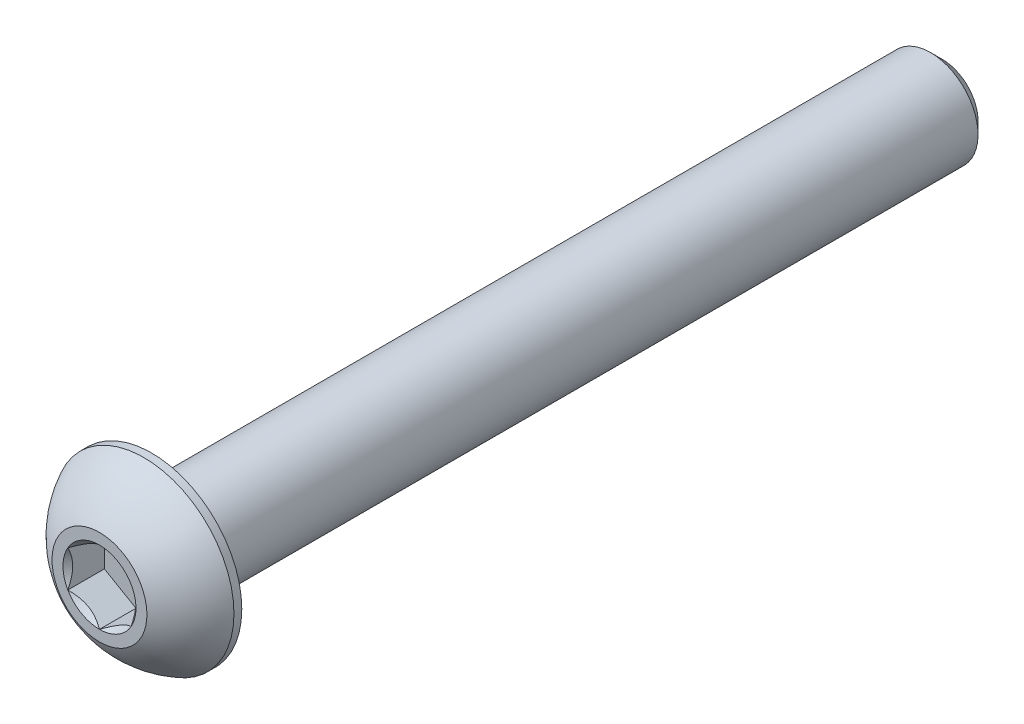
ISO-10303-21;
HEADER;
FILE_DESCRIPTION(('STEP AP214'),'2;1');
FILE_NAME('part.step','',(''),(''),'','','');
FILE_SCHEMA(('AUTOMOTIVE_DESIGN { 1 0 10303 214 1 1 1 1 }'));
ENDSEC;
DATA;
#1=APPLICATION_CONTEXT('core data for automotive mechanical design processes');
#2=APPLICATION_PROTOCOL_DEFINITION('international standard','automotive_design',2000,#1);
#3=PRODUCT_CONTEXT('',#1,'mechanical');
#4=PRODUCT('Part','Part','',(#3));
#5=PRODUCT_RELATED_PRODUCT_CATEGORY('part','',(#4));
#6=PRODUCT_DEFINITION_FORMATION('','',#4);
#7=PRODUCT_DEFINITION_CONTEXT('part definition',#1,'design');
#8=PRODUCT_DEFINITION('design','',#6,#7);
#9=PRODUCT_DEFINITION_SHAPE('','',#8);
#10=(LENGTH_UNIT() NAMED_UNIT(*) SI_UNIT(.MILLI.,.METRE.));
#11=(NAMED_UNIT(*) PLANE_ANGLE_UNIT() SI_UNIT($,.RADIAN.));
#12=(NAMED_UNIT(*) SI_UNIT($,.STERADIAN.) SOLID_ANGLE_UNIT());
#13=UNCERTAINTY_MEASURE_WITH_UNIT(LENGTH_MEASURE(1.E-05),#10,'distance_accuracy_value','');
#14=(GEOMETRIC_REPRESENTATION_CONTEXT(3) GLOBAL_UNCERTAINTY_ASSIGNED_CONTEXT((#13)) GLOBAL_UNIT_ASSIGNED_CONTEXT((#10,
#11,#12)) REPRESENTATION_CONTEXT('',''));
#15=CARTESIAN_POINT('',(0.,0.,0.));
#16=DIRECTION('',(0.,0.,1.));
#17=DIRECTION('',(1.,0.,0.));
#18=AXIS2_PLACEMENT_3D('',#15,#16,#17);
#19=CARTESIAN_POINT('',(0.,-1.5,-26.65));
#20=DIRECTION('',(0.,0.,-1.));
#21=DIRECTION('',(0.,1.,0.));
#22=AXIS2_PLACEMENT_3D('',#19,#20,#21);
#23=PLANE('',#22);
#24=CARTESIAN_POINT('',(0.,0.,-26.65));
#25=DIRECTION('',(0.,0.,-1.));
#26=DIRECTION('',(0.,1.,0.));
#27=AXIS2_PLACEMENT_3D('',#24,#25,#26);
#28=CIRCLE('',#27,1.125);
#29=CARTESIAN_POINT('',(0.,1.125,-26.65));
#30=VERTEX_POINT('',#29);
#31=EDGE_CURVE('E173',#30,#30,#28,.T.);
#32=ORIENTED_EDGE('',*,*,#31,.T.);
#33=EDGE_LOOP('',(#32));
#34=FACE_BOUND('',#33,.T.);
#35=ADVANCED_FACE('F34',(#34),#23,.T.);
#36=CARTESIAN_POINT('',(0.,0.,-26.65));
#37=DIRECTION('',(0.,0.,-1.));
#38=DIRECTION('',(0.,1.,0.));
#39=AXIS2_PLACEMENT_3D('',#36,#37,#38);
#40=CYLINDRICAL_SURFACE('',#39,1.5);
#41=CARTESIAN_POINT('',(0.,0.,-26.275));
#42=DIRECTION('',(0.,0.,-1.));
#43=DIRECTION('',(0.,1.,0.));
#44=AXIS2_PLACEMENT_3D('',#41,#42,#43);
#45=CIRCLE('',#44,1.5);
#46=CARTESIAN_POINT('',(0.,1.5,-26.275));
#47=VERTEX_POINT('',#46);
#48=EDGE_CURVE('E47',#47,#47,#45,.F.);
#49=ORIENTED_EDGE('',*,*,#48,.T.);
#50=EDGE_LOOP('',(#49));
#51=FACE_BOUND('',#50,.T.);
#52=CARTESIAN_POINT('',(0.,0.,-1.65));
#53=DIRECTION('',(0.,0.,1.));
#54=DIRECTION('',(1.,0.,0.));
#55=AXIS2_PLACEMENT_3D('',#52,#53,#54);
#56=CIRCLE('',#55,1.5);
#57=CARTESIAN_POINT('',(1.5,0.,-1.65));
#58=VERTEX_POINT('',#57);
#59=EDGE_CURVE('E170',#58,#58,#56,.F.);
#60=ORIENTED_EDGE('',*,*,#59,.T.);
#61=EDGE_LOOP('',(#60));
#62=FACE_BOUND('',#61,.T.);
#63=ADVANCED_FACE('F178',(#51,#62),#40,.T.);
#64=CARTESIAN_POINT('',(0.,0.,-26.65));
#65=DIRECTION('',(0.,0.,1.));
#66=DIRECTION('',(0.,-1.,0.));
#67=AXIS2_PLACEMENT_3D('',#64,#65,#66);
#68=CONICAL_SURFACE('',#67,1.125,0.785398163397447);
#69=ORIENTED_EDGE('',*,*,#48,.F.);
#70=EDGE_LOOP('',(#69));
#71=FACE_BOUND('',#70,.T.);
#72=ORIENTED_EDGE('',*,*,#31,.F.);
#73=EDGE_LOOP('',(#72));
#74=FACE_BOUND('',#73,.T.);
#75=ADVANCED_FACE('F36',(#71,#74),#68,.T.);
#76=CARTESIAN_POINT('',(0.,0.,-2.79483288770053));
#77=DIRECTION('',(0.,0.,1.));
#78=DIRECTION('',(0.,-1.,0.));
#79=AXIS2_PLACEMENT_3D('',#76,#77,#78);
#80=SPHERICAL_SURFACE('',#79,3.17192226735973);
#81=CARTESIAN_POINT('',(0.,0.,0.));
#82=DIRECTION('',(0.,0.,1.));
#83=DIRECTION('',(1.,0.,0.));
#84=AXIS2_PLACEMENT_3D('',#81,#82,#83);
#85=CIRCLE('',#84,1.5);
#86=CARTESIAN_POINT('',(0.,-1.5,0.));
#87=VERTEX_POINT('',#86);
#88=EDGE_CURVE('E167',#87,#87,#85,.T.);
#89=CARTESIAN_POINT('',(0.,0.,-1.4025));
#90=DIRECTION('',(0.,0.,1.));
#91=DIRECTION('',(1.,0.,0.));
#92=AXIS2_PLACEMENT_3D('',#89,#90,#91);
#93=CIRCLE('',#92,2.85);
#94=CARTESIAN_POINT('',(0.,-2.85,-1.4025));
#95=VERTEX_POINT('',#94);
#96=EDGE_CURVE('E161',#95,#95,#93,.T.);
#97=CARTESIAN_POINT('',(0.,-1.5,0.));
#98=CARTESIAN_POINT('',(0.,-1.5181600798921,-0.00974656947336528));
#99=CARTESIAN_POINT('',(0.,-1.53622513742981,-0.0196701847238475));
#100=CARTESIAN_POINT('',(0.,-1.57215840256594,-0.0398676311293121));
#101=CARTESIAN_POINT('',(0.,-1.59002661016438,-0.0501414622842944));
#102=CARTESIAN_POINT('',(0.,-1.6255593701915,-0.0710354648490241));
#103=CARTESIAN_POINT('',(0.,-1.64322392262019,-0.0816556362587714));
#104=CARTESIAN_POINT('',(0.,-1.67834266450262,-0.103238276426967));
#105=CARTESIAN_POINT('',(0.,-1.69579685395636,-0.114200745185416));
#106=CARTESIAN_POINT('',(0.,-1.73048823664554,-0.136463816635606));
#107=CARTESIAN_POINT('',(0.,-1.74772542988099,-0.147764419327347));
#108=CARTESIAN_POINT('',(0.,-1.78197627078176,-0.170699464187153));
#109=CARTESIAN_POINT('',(0.,-1.79898991844709,-0.182333906355219));
#110=CARTESIAN_POINT('',(0.,-1.83278720341135,-0.205932209546912));
#111=CARTESIAN_POINT('',(0.,-1.84957084071028,-0.21789607057054));
#112=CARTESIAN_POINT('',(0.,-1.88290172764636,-0.242148665498754));
#113=CARTESIAN_POINT('',(0.,-1.89944897728351,-0.254437399403341));
#114=CARTESIAN_POINT('',(0.,-1.93230080139369,-0.279335070725423));
#115=CARTESIAN_POINT('',(0.,-1.94860537586673,-0.291944008142919));
#116=CARTESIAN_POINT('',(0.,-1.98096565436365,-0.317477295441111));
#117=CARTESIAN_POINT('',(0.,-1.99702135838753,-0.330401645321807));
#118=CARTESIAN_POINT('',(0.,-2.02887779526297,-0.356560846652225));
#119=CARTESIAN_POINT('',(0.,-2.04467852811452,-0.369795698101948));
#120=CARTESIAN_POINT('',(0.,-2.07601901880464,-0.396570873693307));
#121=CARTESIAN_POINT('',(0.,-2.09155877664321,-0.410111197834942));
#122=CARTESIAN_POINT('',(0.,-2.12237141262985,-0.437492173862106));
#123=CARTESIAN_POINT('',(0.,-2.13764429077792,-0.451332825747633));
#124=CARTESIAN_POINT('',(0.,-2.16791736411296,-0.479309198198268));
#125=CARTESIAN_POINT('',(0.,-2.18291755929993,-0.493444918763374));
#126=CARTESIAN_POINT('',(0.,-2.21263956705415,-0.52200605739095));
#127=CARTESIAN_POINT('',(0.,-2.22736137962139,-0.536431475453418));
#128=CARTESIAN_POINT('',(0.,-2.2565210282552,-0.56556652781647));
#129=CARTESIAN_POINT('',(0.,-2.27095886432178,-0.580276162117054));
#130=CARTESIAN_POINT('',(0.,-2.2995450739765,-0.609974057702794));
#131=CARTESIAN_POINT('',(0.,-2.31369344756465,-0.624962318987951));
#132=CARTESIAN_POINT('',(0.,-2.34169535627252,-0.655211773418758));
#133=CARTESIAN_POINT('',(0.,-2.35554889139224,-0.670472966564409));
#134=CARTESIAN_POINT('',(0.,-2.38295585920366,-0.701262485885582));
#135=CARTESIAN_POINT('',(0.,-2.39650929189537,-0.716790812061104));
#136=CARTESIAN_POINT('',(0.,-2.42331090492182,-0.748108697108241));
#137=CARTESIAN_POINT('',(0.,-2.43655908525656,-0.763898255979857));
#138=CARTESIAN_POINT('',(0.,-2.46274515962755,-0.795732606824226));
#139=CARTESIAN_POINT('',(0.,-2.47568305366379,-0.811777398796979));
#140=CARTESIAN_POINT('',(0.,-2.50124363939651,-0.844116119267125));
#141=CARTESIAN_POINT('',(0.,-2.51386633109298,-0.860410047764518));
#142=CARTESIAN_POINT('',(0.,-2.53879171587278,-0.893240850042598));
#143=CARTESIAN_POINT('',(0.,-2.55109440895612,-0.909777723823286));
#144=CARTESIAN_POINT('',(0.,-2.57537512182785,-0.943088133113639));
#145=CARTESIAN_POINT('',(0.,-2.58735314161625,-0.959861668623304));
#146=CARTESIAN_POINT('',(0.,-2.61097995657956,-0.993639027894245));
#147=CARTESIAN_POINT('',(0.,-2.62262875175448,-1.01064285165552));
#148=CARTESIAN_POINT('',(0.,-2.64559269128198,-1.04487432644225));
#149=CARTESIAN_POINT('',(0.,-2.65690783563458,-1.06210197746771));
#150=CARTESIAN_POINT('',(0.,-2.67920017403639,-1.09677456077299));
#151=CARTESIAN_POINT('',(0.,-2.69017736808561,-1.11421949305282));
#152=CARTESIAN_POINT('',(0.,-2.711789634999,-1.14932001019995));
#153=CARTESIAN_POINT('',(0.,-2.72242470786316,-1.16697559506725));
#154=CARTESIAN_POINT('',(0.,-2.74334869082118,-1.20249070903942));
#155=CARTESIAN_POINT('',(0.,-2.75363760091502,-1.22035023814429));
#156=CARTESIAN_POINT('',(0.,-2.77386535089241,-1.25626645340824));
#157=CARTESIAN_POINT('',(0.,-2.78380419077596,-1.27432313956732));
#158=CARTESIAN_POINT('',(0.,-2.80332801615778,-1.31062681184411));
#159=CARTESIAN_POINT('',(0.,-2.81291300165605,-1.32887379796182));
#160=CARTESIAN_POINT('',(0.,-2.83172550494215,-1.3655511220839));
#161=CARTESIAN_POINT('',(0.,-2.84095302272998,-1.38398146008827));
#162=CARTESIAN_POINT('',(0.,-2.85,-1.4025));
#163=B_SPLINE_CURVE_WITH_KNOTS('',3,(#97,#98,#99,#100,#101,#102,#103,#104,#105,#106,#107,#108,
#109,#110,#111,#112,#113,#114,#115,#116,#117,#118,#119,#120,#121,#122,#123,#124,#125,#126,#127,
#128,#129,#130,#131,#132,#133,#134,#135,#136,#137,#138,#139,#140,#141,#142,#143,#144,#145,#146,
#147,#148,#149,#150,#151,#152,#153,#154,#155,#156,#157,#158,#159,#160,#161,#162),.UNSPECIFIED.,
.F.,.F.,(4,2,2,2,2,2,2,2,2,2,2,2,2,2,2,2,2,2,2,2,2,2,2,2,2,2,2,2,2,2,2,2,4),(0.,
0.0618298941826979,0.123659788365397,0.185489682548095,0.247319576730792,0.309149470913491,
0.370979365096189,0.432809259278888,0.494639153461586,0.556469047644284,0.618298941826982,
0.68012883600968,0.741958730192378,0.803788624375077,0.865618518557775,0.927448412740473,
0.989278306923171,1.05110820110587,1.11293809528857,1.17476798947127,1.23659788365396,
1.29842777783666,1.36025767201936,1.42208756620206,1.48391746038476,1.54574735456745,
1.60757724875015,1.66940714293285,1.73123703711555,1.79306693129825,1.85489682548095,
1.91672671966364,1.97855661384634),.UNSPECIFIED.);
#164=EDGE_CURVE('BSEAM183',#87,#95,#163,.T.);
#165=ORIENTED_EDGE('',*,*,#88,.F.);
#166=ORIENTED_EDGE('',*,*,#96,.T.);
#167=ORIENTED_EDGE('',*,*,#164,.T.);
#168=ORIENTED_EDGE('',*,*,#164,.F.);
#169=EDGE_LOOP('',(#165,#167,#166,#168));
#170=FACE_BOUND('',#169,.T.);
#171=ADVANCED_FACE('F183',(#170),#80,.T.);
#172=CARTESIAN_POINT('',(0.,-1.5,0.));
#173=DIRECTION('',(0.,0.,-1.));
#174=DIRECTION('',(-1.,0.,0.));
#175=AXIS2_PLACEMENT_3D('',#172,#173,#174);
#176=PLANE('',#175);
#177=CARTESIAN_POINT('',(0.,0.,0.));
#178=DIRECTION('',(0.,0.,1.));
#179=DIRECTION('',(1.,0.,0.));
#180=AXIS2_PLACEMENT_3D('',#177,#178,#179);
#181=CIRCLE('',#180,1.15470053837925);
#182=CARTESIAN_POINT('',(-1.,0.577350269189626,0.));
#183=VERTEX_POINT('',#182);
#184=CARTESIAN_POINT('',(-1.,-0.577350269189626,0.));
#185=VERTEX_POINT('',#184);
#186=EDGE_CURVE('E60',#183,#185,#181,.T.);
#187=ORIENTED_EDGE('',*,*,#186,.F.);
#188=CARTESIAN_POINT('',(0.,1.15470053837925,0.));
#189=VERTEX_POINT('',#188);
#190=EDGE_CURVE('E132',#189,#183,#181,.T.);
#191=ORIENTED_EDGE('',*,*,#190,.F.);
#192=CARTESIAN_POINT('',(1.,0.577350269189626,0.));
#193=VERTEX_POINT('',#192);
#194=EDGE_CURVE('E129',#193,#189,#181,.T.);
#195=ORIENTED_EDGE('',*,*,#194,.F.);
#196=CARTESIAN_POINT('',(1.,-0.577350269189626,0.));
#197=VERTEX_POINT('',#196);
#198=EDGE_CURVE('E100',#197,#193,#181,.T.);
#199=ORIENTED_EDGE('',*,*,#198,.F.);
#200=CARTESIAN_POINT('',(0.,-1.15470053837925,0.));
#201=VERTEX_POINT('',#200);
#202=EDGE_CURVE('E92',#201,#197,#181,.T.);
#203=ORIENTED_EDGE('',*,*,#202,.F.);
#204=EDGE_CURVE('E53',#185,#201,#181,.T.);
#205=ORIENTED_EDGE('',*,*,#204,.F.);
#206=EDGE_LOOP('',(#187,#191,#195,#199,#203,#205));
#207=FACE_BOUND('',#206,.T.);
#208=ORIENTED_EDGE('',*,*,#88,.T.);
#209=EDGE_LOOP('',(#208));
#210=FACE_BOUND('',#209,.T.);
#211=ADVANCED_FACE('F126',(#207,#210),#176,.F.);
#212=CARTESIAN_POINT('',(0.,-2.85,-1.65));
#213=DIRECTION('',(0.,0.,1.));
#214=DIRECTION('',(1.,0.,0.));
#215=AXIS2_PLACEMENT_3D('',#212,#213,#214);
#216=PLANE('',#215);
#217=ORIENTED_EDGE('',*,*,#59,.F.);
#218=EDGE_LOOP('',(#217));
#219=FACE_BOUND('',#218,.T.);
#220=CARTESIAN_POINT('',(0.,0.,-1.65));
#221=DIRECTION('',(0.,0.,1.));
#222=DIRECTION('',(1.,0.,0.));
#223=AXIS2_PLACEMENT_3D('',#220,#221,#222);
#224=CIRCLE('',#223,2.85);
#225=CARTESIAN_POINT('',(2.85,0.,-1.65));
#226=VERTEX_POINT('',#225);
#227=EDGE_CURVE('E164',#226,#226,#224,.T.);
#228=ORIENTED_EDGE('',*,*,#227,.F.);
#229=EDGE_LOOP('',(#228));
#230=FACE_BOUND('',#229,.T.);
#231=ADVANCED_FACE('F197',(#219,#230),#216,.F.);
#232=CARTESIAN_POINT('',(0.,0.,0.));
#233=DIRECTION('',(0.,0.,1.));
#234=DIRECTION('',(1.,0.,0.));
#235=AXIS2_PLACEMENT_3D('',#232,#233,#234);
#236=CYLINDRICAL_SURFACE('',#235,2.85);
#237=ORIENTED_EDGE('',*,*,#96,.F.);
#238=EDGE_LOOP('',(#237));
#239=FACE_BOUND('',#238,.T.);
#240=ORIENTED_EDGE('',*,*,#227,.T.);
#241=EDGE_LOOP('',(#240));
#242=FACE_BOUND('',#241,.T.);
#243=ADVANCED_FACE('F200',(#239,#242),#236,.T.);
#244=CARTESIAN_POINT('',(0.,0.,0.));
#245=DIRECTION('',(0.,0.,1.));
#246=DIRECTION('',(1.,0.,0.));
#247=AXIS2_PLACEMENT_3D('',#244,#245,#246);
#248=CONICAL_SURFACE('',#247,1.15470053837925,0.78539816339745);
#249=ORIENTED_EDGE('',*,*,#198,.T.);
#250=CARTESIAN_POINT('',(1.,-1.15147208646462,0.37038567751386));
#251=CARTESIAN_POINT('',(1.,-1.12343447988552,0.349219919873711));
#252=CARTESIAN_POINT('',(1.,-1.09524064850697,0.328261692175909));
#253=CARTESIAN_POINT('',(1.,-1.03847715644376,0.28684602223562));
#254=CARTESIAN_POINT('',(1.,-1.00990740382975,0.266388706123658));
#255=CARTESIAN_POINT('',(1.,-0.923120894333476,0.205604794954508));
#256=CARTESIAN_POINT('',(1.,-0.864253173759059,0.166192228961397));
#257=CARTESIAN_POINT('',(1.,-0.740809858258045,0.0888206642002041));
#258=CARTESIAN_POINT('',(1.,-0.676100255137807,0.0510730391143413));
#259=CARTESIAN_POINT('',(1.,-0.543448939049124,-0.0179754124487091));
#260=CARTESIAN_POINT('',(1.,-0.475519112027778,-0.0492979721531354));
#261=CARTESIAN_POINT('',(1.,-0.373555850333528,-0.0876182211162059));
#262=CARTESIAN_POINT('',(1.,-0.341031989670907,-0.0986164083578445));
#263=CARTESIAN_POINT('',(1.,-0.275199079052293,-0.11800165785264));
#264=CARTESIAN_POINT('',(1.,-0.241889975173933,-0.126388540223302));
#265=CARTESIAN_POINT('',(1.,-0.175247517042992,-0.139974779280984));
#266=CARTESIAN_POINT('',(1.,-0.141925568218174,-0.145229209232033));
#267=CARTESIAN_POINT('',(1.,-0.0749144362322786,-0.152451313429108));
#268=CARTESIAN_POINT('',(1.,-0.0412251978501615,-0.154418486389493));
#269=CARTESIAN_POINT('',(1.,0.0249580992634212,-0.15491680160684));
#270=CARTESIAN_POINT('',(1.,0.0574512826460394,-0.153569732111366));
#271=CARTESIAN_POINT('',(1.,0.122148505701867,-0.147783515501016));
#272=CARTESIAN_POINT('',(1.,0.154352610132927,-0.143345079338465));
#273=CARTESIAN_POINT('',(1.,0.21879989886764,-0.131543169854797));
#274=CARTESIAN_POINT('',(1.,0.251033743268954,-0.124129458961492));
#275=CARTESIAN_POINT('',(1.,0.314797132354919,-0.106771057501325));
#276=CARTESIAN_POINT('',(1.,0.346326735731005,-0.096826578711171));
#277=CARTESIAN_POINT('',(1.,0.445594187730205,-0.061776517445664));
#278=CARTESIAN_POINT('',(1.,0.511919139476037,-0.0326791416432762));
#279=CARTESIAN_POINT('',(1.,0.641453244657532,0.032015329686504));
#280=CARTESIAN_POINT('',(1.,0.704650133126344,0.0676357767152409));
#281=CARTESIAN_POINT('',(1.,0.825428490174987,0.141123901346934));
#282=CARTESIAN_POINT('',(1.,0.883132947867685,0.178791947135463));
#283=CARTESIAN_POINT('',(1.,0.968148853704565,0.237022852943162));
#284=CARTESIAN_POINT('',(1.,0.996120570380285,0.256638475762855));
#285=CARTESIAN_POINT('',(1.,1.05168177729901,0.29638851706127));
#286=CARTESIAN_POINT('',(1.,1.079271369977,0.316522792198831));
#287=CARTESIAN_POINT('',(1.,1.10670185346329,0.336872119072971));
#288=B_SPLINE_CURVE_WITH_KNOTS('',3,(#250,#251,#252,#253,#254,#255,#256,#257,#258,#259,#260,
#261,#262,#263,#264,#265,#266,#267,#268,#269,#270,#271,#272,#273,#274,#275,#276,#277,#278,#279,
#280,#281,#282,#283,#284,#285,#286,#287),.UNSPECIFIED.,.F.,.F.,(4,2,2,2,2,2,2,2,2,2,2,2,2,2,2,2,
2,2,4),(0.,0.105386459083291,0.210799187330124,0.423233611565468,0.647793540908503,
0.871580877738609,0.97449307418142,1.07741235827201,1.17846428203205,1.27953161415762,
1.3769408673961,1.47432772585408,1.57343322804293,1.67253043972851,1.88917353996827,
2.10660791038813,2.31323734249843,2.41572589232044,2.51818641476503),.UNSPECIFIED.);
#289=EDGE_CURVE('E11',#197,#193,#288,.T.);
#290=ORIENTED_EDGE('',*,*,#289,.F.);
#291=EDGE_LOOP('',(#249,#290));
#292=FACE_BOUND('',#291,.T.);
#293=ADVANCED_FACE('F104',(#292),#248,.F.);
#294=ORIENTED_EDGE('',*,*,#194,.T.);
#295=CARTESIAN_POINT('',(1.0002,0.577234799135788,0.00011548737261379));
#296=CARTESIAN_POINT('',(0.965817404992819,0.597085599618622,-0.0197220691742672));
#297=CARTESIAN_POINT('',(0.930859881860175,0.617268335009457,-0.0383949793611113));
#298=CARTESIAN_POINT('',(0.85957719704391,0.658423412276686,-0.0725852572768423));
#299=CARTESIAN_POINT('',(0.823245249471016,0.67939967198808,-0.0880835909765416));
#300=CARTESIAN_POINT('',(0.749983386196689,0.721697428470847,-0.114632692857735));
#301=CARTESIAN_POINT('',(0.713072148554586,0.743008141459637,-0.125750226003074));
#302=CARTESIAN_POINT('',(0.638437270689141,0.786098608286186,-0.142880134223818));
#303=CARTESIAN_POINT('',(0.600715911891364,0.807877044942281,-0.148905302533328));
#304=CARTESIAN_POINT('',(0.535707801582067,0.845409494928863,-0.154339445032507));
#305=CARTESIAN_POINT('',(0.508505628471828,0.861114676896602,-0.155143061683268));
#306=CARTESIAN_POINT('',(0.454153959330888,0.892494627706029,-0.153793300583113));
#307=CARTESIAN_POINT('',(0.427004476245124,0.908169389073954,-0.151639270452801));
#308=CARTESIAN_POINT('',(0.34594372267304,0.954969836969511,-0.140883027871529));
#309=CARTESIAN_POINT('',(0.292435859021573,0.985862616452447,-0.127985443584644));
#310=CARTESIAN_POINT('',(0.198523934856568,1.04008269114923,-0.0968592693978228));
#311=CARTESIAN_POINT('',(0.157679476328165,1.06366425027551,-0.0802622022981607));
#312=CARTESIAN_POINT('',(0.0775903626180559,1.1099037216352,-0.0428750753147074));
#313=CARTESIAN_POINT('',(0.0383409891295618,1.1325643579843,-0.0220986581825969));
#314=CARTESIAN_POINT('',(-0.000200000000000448,1.15481600843309,0.000115487372613952));
#315=B_SPLINE_CURVE_WITH_KNOTS('',3,(#295,#296,#297,#298,#299,#300,#301,#302,#303,#304,#305,
#306,#307,#308,#309,#310,#311,#312,#313,#314),.UNSPECIFIED.,.F.,.F.,(4,2,2,2,2,2,2,2,2,4),(0.,
0.133237676828559,0.26725222983449,0.3991370762693,0.530689603280768,0.624814864263846,
0.718960890149133,0.907306626112097,1.05710100361789,1.20641411519286),.UNSPECIFIED.);
#316=EDGE_CURVE('E131',#193,#189,#315,.T.);
#317=ORIENTED_EDGE('',*,*,#316,.F.);
#318=EDGE_LOOP('',(#294,#317));
#319=FACE_BOUND('',#318,.T.);
#320=ADVANCED_FACE('F280',(#319),#248,.F.);
#321=ORIENTED_EDGE('',*,*,#190,.T.);
#322=CARTESIAN_POINT('',(0.000199999999999653,1.15481600843309,0.000115487372613877));
#323=CARTESIAN_POINT('',(-0.034182595007181,1.13496520795026,-0.0197220691742673));
#324=CARTESIAN_POINT('',(-0.0691401181398251,1.11478247255942,-0.0383949793611114));
#325=CARTESIAN_POINT('',(-0.14042280295609,1.07362739529219,-0.0725852572768422));
#326=CARTESIAN_POINT('',(-0.176754750528985,1.0526511355808,-0.0880835909765414));
#327=CARTESIAN_POINT('',(-0.250016613803312,1.01035337909803,-0.114632692857735));
#328=CARTESIAN_POINT('',(-0.286927851445415,0.989042666109241,-0.125750226003074));
#329=CARTESIAN_POINT('',(-0.36156272931086,0.945952199282691,-0.142880134223818));
#330=CARTESIAN_POINT('',(-0.399284088108636,0.924173762626596,-0.148905302533328));
#331=CARTESIAN_POINT('',(-0.464292198417934,0.886641312640014,-0.154339445032506));
#332=CARTESIAN_POINT('',(-0.491494371528172,0.870936130672275,-0.155143061683268));
#333=CARTESIAN_POINT('',(-0.545846040669112,0.839556179862848,-0.153793300583113));
#334=CARTESIAN_POINT('',(-0.572995523754876,0.823881418494923,-0.151639270452801));
#335=CARTESIAN_POINT('',(-0.65405627732696,0.777080970599367,-0.140883027871529));
#336=CARTESIAN_POINT('',(-0.707564140978428,0.74618819111643,-0.127985443584644));
#337=CARTESIAN_POINT('',(-0.801476065143432,0.691968116419649,-0.096859269397823));
#338=CARTESIAN_POINT('',(-0.842320523671834,0.668386557293371,-0.0802622022981609));
#339=CARTESIAN_POINT('',(-0.922409637381944,0.622147085933681,-0.0428750753147075));
#340=CARTESIAN_POINT('',(-0.961659010870438,0.599486449584575,-0.0220986581825969));
#341=CARTESIAN_POINT('',(-1.0002,0.577234799135788,0.000115487372613623));
#342=B_SPLINE_CURVE_WITH_KNOTS('',3,(#322,#323,#324,#325,#326,#327,#328,#329,#330,#331,#332,
#333,#334,#335,#336,#337,#338,#339,#340,#341),.UNSPECIFIED.,.F.,.F.,(4,2,2,2,2,2,2,2,2,4),(0.,
0.133237676828559,0.26725222983449,0.3991370762693,0.530689603280768,0.624814864263846,
0.718960890149133,0.907306626112098,1.05710100361789,1.20641411519286),.UNSPECIFIED.);
#343=EDGE_CURVE('E136',#189,#183,#342,.T.);
#344=ORIENTED_EDGE('',*,*,#343,.F.);
#345=EDGE_LOOP('',(#321,#344));
#346=FACE_BOUND('',#345,.T.);
#347=ADVANCED_FACE('F139',(#346),#248,.F.);
#348=ORIENTED_EDGE('',*,*,#186,.T.);
#349=CARTESIAN_POINT('',(-1.,-1.15147208646462,0.370385677513861));
#350=CARTESIAN_POINT('',(-1.,-1.12343447988552,0.349219919873711));
#351=CARTESIAN_POINT('',(-1.,-1.09524064850697,0.328261692175909));
#352=CARTESIAN_POINT('',(-1.,-1.03847715644376,0.286846022235621));
#353=CARTESIAN_POINT('',(-1.,-1.00990740382975,0.266388706123658));
#354=CARTESIAN_POINT('',(-1.,-0.923120894333477,0.205604794954509));
#355=CARTESIAN_POINT('',(-1.,-0.86425317375906,0.166192228961397));
#356=CARTESIAN_POINT('',(-1.,-0.740809858258046,0.0888206642002046));
#357=CARTESIAN_POINT('',(-1.,-0.676100255137807,0.0510730391143418));
#358=CARTESIAN_POINT('',(-1.,-0.543448939049125,-0.0179754124487088));
#359=CARTESIAN_POINT('',(-1.,-0.475519112027779,-0.0492979721531352));
#360=CARTESIAN_POINT('',(-1.,-0.373555850333529,-0.0876182211162059));
#361=CARTESIAN_POINT('',(-1.,-0.341031989670908,-0.0986164083578445));
#362=CARTESIAN_POINT('',(-1.,-0.275199079052293,-0.11800165785264));
#363=CARTESIAN_POINT('',(-1.,-0.241889975173933,-0.126388540223302));
#364=CARTESIAN_POINT('',(-1.,-0.175247517042993,-0.139974779280984));
#365=CARTESIAN_POINT('',(-1.,-0.141925568218175,-0.145229209232033));
#366=CARTESIAN_POINT('',(-1.,-0.074914436232279,-0.152451313429108));
#367=CARTESIAN_POINT('',(-1.,-0.0412251978501618,-0.154418486389493));
#368=CARTESIAN_POINT('',(-1.,0.0249580992634209,-0.15491680160684));
#369=CARTESIAN_POINT('',(-1.,0.0574512826460391,-0.153569732111367));
#370=CARTESIAN_POINT('',(-1.,0.122148505701867,-0.147783515501016));
#371=CARTESIAN_POINT('',(-1.,0.154352610132926,-0.143345079338465));
#372=CARTESIAN_POINT('',(-1.,0.21879989886764,-0.131543169854797));
#373=CARTESIAN_POINT('',(-1.,0.251033743268953,-0.124129458961492));
#374=CARTESIAN_POINT('',(-1.,0.314797132354919,-0.106771057501325));
#375=CARTESIAN_POINT('',(-1.,0.346326735731004,-0.0968265787111712));
#376=CARTESIAN_POINT('',(-1.,0.445594187730205,-0.0617765174456643));
#377=CARTESIAN_POINT('',(-1.,0.511919139476036,-0.0326791416432765));
#378=CARTESIAN_POINT('',(-1.,0.641453244657531,0.0320153296865035));
#379=CARTESIAN_POINT('',(-1.,0.704650133126343,0.0676357767152402));
#380=CARTESIAN_POINT('',(-1.,0.825428490174986,0.141123901346934));
#381=CARTESIAN_POINT('',(-1.,0.883132947867684,0.178791947135462));
#382=CARTESIAN_POINT('',(-1.,0.968148853704564,0.237022852943162));
#383=CARTESIAN_POINT('',(-1.,0.996120570380284,0.256638475762855));
#384=CARTESIAN_POINT('',(-1.,1.05168177729901,0.296388517061269));
#385=CARTESIAN_POINT('',(-1.,1.079271369977,0.31652279219883));
#386=CARTESIAN_POINT('',(-1.,1.10670185346329,0.33687211907297));
#387=B_SPLINE_CURVE_WITH_KNOTS('',3,(#349,#350,#351,#352,#353,#354,#355,#356,#357,#358,#359,
#360,#361,#362,#363,#364,#365,#366,#367,#368,#369,#370,#371,#372,#373,#374,#375,#376,#377,#378,
#379,#380,#381,#382,#383,#384,#385,#386),.UNSPECIFIED.,.F.,.F.,(4,2,2,2,2,2,2,2,2,2,2,2,2,2,2,2,
2,2,4),(0.,0.105386459083291,0.210799187330125,0.423233611565469,0.647793540908503,
0.87158087773861,0.974493074181421,1.07741235827201,1.17846428203205,1.27953161415762,
1.3769408673961,1.47432772585408,1.57343322804293,1.67253043972851,1.88917353996827,
2.10660791038813,2.31323734249843,2.41572589232044,2.51818641476503),.UNSPECIFIED.);
#388=EDGE_CURVE('E143',#183,#185,#387,.F.);
#389=ORIENTED_EDGE('',*,*,#388,.F.);
#390=EDGE_LOOP('',(#348,#389));
#391=FACE_BOUND('',#390,.T.);
#392=ADVANCED_FACE('F274',(#391),#248,.F.);
#393=ORIENTED_EDGE('',*,*,#204,.T.);
#394=CARTESIAN_POINT('',(-1.0002,-0.577234799135788,0.00011548737261379));
#395=CARTESIAN_POINT('',(-0.965817404992819,-0.597085599618622,-0.0197220691742671));
#396=CARTESIAN_POINT('',(-0.930859881860175,-0.617268335009456,-0.0383949793611112));
#397=CARTESIAN_POINT('',(-0.85957719704391,-0.658423412276686,-0.0725852572768422));
#398=CARTESIAN_POINT('',(-0.823245249471016,-0.67939967198808,-0.0880835909765416));
#399=CARTESIAN_POINT('',(-0.749983386196689,-0.721697428470847,-0.114632692857735));
#400=CARTESIAN_POINT('',(-0.713072148554586,-0.743008141459637,-0.125750226003074));
#401=CARTESIAN_POINT('',(-0.638437270689141,-0.786098608286186,-0.142880134223818));
#402=CARTESIAN_POINT('',(-0.600715911891364,-0.807877044942281,-0.148905302533327));
#403=CARTESIAN_POINT('',(-0.535707801582066,-0.845409494928863,-0.154339445032506));
#404=CARTESIAN_POINT('',(-0.508505628471828,-0.861114676896602,-0.155143061683268));
#405=CARTESIAN_POINT('',(-0.454153959330888,-0.892494627706029,-0.153793300583113));
#406=CARTESIAN_POINT('',(-0.427004476245124,-0.908169389073954,-0.151639270452801));
#407=CARTESIAN_POINT('',(-0.34594372267304,-0.954969836969511,-0.140883027871529));
#408=CARTESIAN_POINT('',(-0.292435859021572,-0.985862616452447,-0.127985443584644));
#409=CARTESIAN_POINT('',(-0.198523934856568,-1.04008269114923,-0.0968592693978226));
#410=CARTESIAN_POINT('',(-0.157679476328166,-1.06366425027551,-0.0802622022981606));
#411=CARTESIAN_POINT('',(-0.0775903626180561,-1.1099037216352,-0.0428750753147073));
#412=CARTESIAN_POINT('',(-0.038340989129562,-1.1325643579843,-0.0220986581825967));
#413=CARTESIAN_POINT('',(0.000200000000000127,-1.15481600843309,0.000115487372614116));
#414=B_SPLINE_CURVE_WITH_KNOTS('',3,(#394,#395,#396,#397,#398,#399,#400,#401,#402,#403,#404,
#405,#406,#407,#408,#409,#410,#411,#412,#413),.UNSPECIFIED.,.F.,.F.,(4,2,2,2,2,2,2,2,2,4),(0.,
0.133237676828559,0.26725222983449,0.3991370762693,0.530689603280768,0.624814864263846,
0.718960890149133,0.907306626112098,1.05710100361789,1.20641411519286),.UNSPECIFIED.);
#415=EDGE_CURVE('E116',#185,#201,#414,.T.);
#416=ORIENTED_EDGE('',*,*,#415,.F.);
#417=EDGE_LOOP('',(#393,#416));
#418=FACE_BOUND('',#417,.T.);
#419=ADVANCED_FACE('F225',(#418),#248,.F.);
#420=ORIENTED_EDGE('',*,*,#202,.T.);
#421=CARTESIAN_POINT('',(-0.000199999999999753,-1.15481600843309,0.000115487372614094));
#422=CARTESIAN_POINT('',(0.0341825950071809,-1.13496520795026,-0.019722069174267));
#423=CARTESIAN_POINT('',(0.0691401181398251,-1.11478247255942,-0.0383949793611112));
#424=CARTESIAN_POINT('',(0.14042280295609,-1.07362739529219,-0.0725852572768422));
#425=CARTESIAN_POINT('',(0.176754750528984,-1.0526511355808,-0.0880835909765414));
#426=CARTESIAN_POINT('',(0.250016613803311,-1.01035337909803,-0.114632692857735));
#427=CARTESIAN_POINT('',(0.286927851445415,-0.989042666109241,-0.125750226003074));
#428=CARTESIAN_POINT('',(0.36156272931086,-0.945952199282691,-0.142880134223818));
#429=CARTESIAN_POINT('',(0.399284088108636,-0.924173762626596,-0.148905302533327));
#430=CARTESIAN_POINT('',(0.464292198417934,-0.886641312640014,-0.154339445032506));
#431=CARTESIAN_POINT('',(0.491494371528173,-0.870936130672275,-0.155143061683268));
#432=CARTESIAN_POINT('',(0.545846040669112,-0.839556179862848,-0.153793300583113));
#433=CARTESIAN_POINT('',(0.572995523754876,-0.823881418494923,-0.151639270452801));
#434=CARTESIAN_POINT('',(0.65405627732696,-0.777080970599366,-0.140883027871529));
#435=CARTESIAN_POINT('',(0.707564140978428,-0.74618819111643,-0.127985443584644));
#436=CARTESIAN_POINT('',(0.801476065143432,-0.691968116419649,-0.0968592693978231));
#437=CARTESIAN_POINT('',(0.842320523671835,-0.668386557293371,-0.0802622022981609));
#438=CARTESIAN_POINT('',(0.922409637381944,-0.622147085933681,-0.0428750753147075));
#439=CARTESIAN_POINT('',(0.961659010870438,-0.599486449584575,-0.022098658182597));
#440=CARTESIAN_POINT('',(1.0002,-0.577234799135788,0.000115487372613542));
#441=B_SPLINE_CURVE_WITH_KNOTS('',3,(#421,#422,#423,#424,#425,#426,#427,#428,#429,#430,#431,
#432,#433,#434,#435,#436,#437,#438,#439,#440),.UNSPECIFIED.,.F.,.F.,(4,2,2,2,2,2,2,2,2,4),(0.,
0.133237676828559,0.26725222983449,0.3991370762693,0.530689603280769,0.624814864263847,
0.718960890149133,0.907306626112098,1.05710100361789,1.20641411519286),.UNSPECIFIED.);
#442=EDGE_CURVE('E96',#201,#197,#441,.T.);
#443=ORIENTED_EDGE('',*,*,#442,.F.);
#444=EDGE_LOOP('',(#420,#443));
#445=FACE_BOUND('',#444,.T.);
#446=ADVANCED_FACE('F94',(#445),#248,.F.);
#447=CARTESIAN_POINT('',(1.,-0.577350269189626,-1.155));
#448=DIRECTION('',(0.,0.,1.));
#449=DIRECTION('',(1.,0.,0.));
#450=AXIS2_PLACEMENT_3D('',#447,#448,#449);
#451=PLANE('',#450);
#452=DIRECTION('',(0.866025403784438,0.500000000000001,0.));
#453=VECTOR('',#452,1.);
#454=CARTESIAN_POINT('',(0.,-1.15470053837925,-1.155));
#455=LINE('',#454,#453);
#456=CARTESIAN_POINT('',(0.,-1.15470053837925,-1.155));
#457=VERTEX_POINT('',#456);
#458=CARTESIAN_POINT('',(1.,-0.577350269189626,-1.155));
#459=VERTEX_POINT('',#458);
#460=EDGE_CURVE('E115',#457,#459,#455,.T.);
#461=ORIENTED_EDGE('',*,*,#460,.T.);
#462=DIRECTION('',(0.,1.,0.));
#463=VECTOR('',#462,1.);
#464=CARTESIAN_POINT('',(1.,-0.577350269189626,-1.155));
#465=LINE('',#464,#463);
#466=CARTESIAN_POINT('',(1.,0.577350269189626,-1.155));
#467=VERTEX_POINT('',#466);
#468=EDGE_CURVE('E120',#459,#467,#465,.T.);
#469=ORIENTED_EDGE('',*,*,#468,.T.);
#470=DIRECTION('',(-0.866025403784439,0.5,0.));
#471=VECTOR('',#470,1.);
#472=CARTESIAN_POINT('',(1.,0.577350269189626,-1.155));
#473=LINE('',#472,#471);
#474=CARTESIAN_POINT('',(0.,1.15470053837925,-1.155));
#475=VERTEX_POINT('',#474);
#476=EDGE_CURVE('E264',#467,#475,#473,.T.);
#477=ORIENTED_EDGE('',*,*,#476,.T.);
#478=DIRECTION('',(-0.866025403784438,-0.5,0.));
#479=VECTOR('',#478,1.);
#480=CARTESIAN_POINT('',(0.,1.15470053837925,-1.155));
#481=LINE('',#480,#479);
#482=CARTESIAN_POINT('',(-1.,0.577350269189626,-1.155));
#483=VERTEX_POINT('',#482);
#484=EDGE_CURVE('E152',#475,#483,#481,.T.);
#485=ORIENTED_EDGE('',*,*,#484,.T.);
#486=DIRECTION('',(0.,-1.,0.));
#487=VECTOR('',#486,1.);
#488=CARTESIAN_POINT('',(-1.,0.577350269189626,-1.155));
#489=LINE('',#488,#487);
#490=CARTESIAN_POINT('',(-1.,-0.577350269189626,-1.155));
#491=VERTEX_POINT('',#490);
#492=EDGE_CURVE('E268',#483,#491,#489,.T.);
#493=ORIENTED_EDGE('',*,*,#492,.T.);
#494=DIRECTION('',(0.866025403784439,-0.5,0.));
#495=VECTOR('',#494,1.);
#496=CARTESIAN_POINT('',(-1.,-0.577350269189626,-1.155));
#497=LINE('',#496,#495);
#498=EDGE_CURVE('E123',#491,#457,#497,.T.);
#499=ORIENTED_EDGE('',*,*,#498,.T.);
#500=EDGE_LOOP('',(#461,#469,#477,#485,#493,#499));
#501=FACE_BOUND('',#500,.T.);
#502=ADVANCED_FACE('F224',(#501),#451,.T.);
#503=CARTESIAN_POINT('',(1.,-0.577350269189626,-1.155));
#504=DIRECTION('',(1.,0.,0.));
#505=DIRECTION('',(0.,0.,-1.));
#506=AXIS2_PLACEMENT_3D('',#503,#504,#505);
#507=PLANE('',#506);
#508=DIRECTION('',(0.,0.,1.));
#509=VECTOR('',#508,1.);
#510=CARTESIAN_POINT('',(1.,-0.577350269189626,-1.155));
#511=LINE('',#510,#509);
#512=EDGE_CURVE('E112',#459,#197,#511,.T.);
#513=ORIENTED_EDGE('',*,*,#512,.T.);
#514=ORIENTED_EDGE('',*,*,#289,.T.);
#515=DIRECTION('',(0.,0.,1.));
#516=VECTOR('',#515,1.);
#517=CARTESIAN_POINT('',(1.,0.577350269189626,-1.155));
#518=LINE('',#517,#516);
#519=EDGE_CURVE('E122',#467,#193,#518,.T.);
#520=ORIENTED_EDGE('',*,*,#519,.F.);
#521=ORIENTED_EDGE('',*,*,#468,.F.);
#522=EDGE_LOOP('',(#513,#514,#520,#521));
#523=FACE_BOUND('',#522,.T.);
#524=ADVANCED_FACE('F118',(#523),#507,.F.);
#525=CARTESIAN_POINT('',(1.,0.577350269189626,-1.155));
#526=DIRECTION('',(0.5,0.866025403784439,0.));
#527=DIRECTION('',(-0.866025403784439,0.5,0.));
#528=AXIS2_PLACEMENT_3D('',#525,#526,#527);
#529=PLANE('',#528);
#530=ORIENTED_EDGE('',*,*,#519,.T.);
#531=ORIENTED_EDGE('',*,*,#316,.T.);
#532=DIRECTION('',(0.,0.,1.));
#533=VECTOR('',#532,1.);
#534=CARTESIAN_POINT('',(0.,1.15470053837925,-1.155));
#535=LINE('',#534,#533);
#536=EDGE_CURVE('E148',#475,#189,#535,.T.);
#537=ORIENTED_EDGE('',*,*,#536,.F.);
#538=ORIENTED_EDGE('',*,*,#476,.F.);
#539=EDGE_LOOP('',(#530,#531,#537,#538));
#540=FACE_BOUND('',#539,.T.);
#541=ADVANCED_FACE('F146',(#540),#529,.F.);
#542=CARTESIAN_POINT('',(0.,1.15470053837925,-1.155));
#543=DIRECTION('',(-0.5,0.866025403784438,0.));
#544=DIRECTION('',(-0.866025403784439,-0.5,0.));
#545=AXIS2_PLACEMENT_3D('',#542,#543,#544);
#546=PLANE('',#545);
#547=ORIENTED_EDGE('',*,*,#536,.T.);
#548=ORIENTED_EDGE('',*,*,#343,.T.);
#549=DIRECTION('',(0.,0.,1.));
#550=VECTOR('',#549,1.);
#551=CARTESIAN_POINT('',(-1.,0.577350269189626,-1.155));
#552=LINE('',#551,#550);
#553=EDGE_CURVE('E154',#483,#183,#552,.T.);
#554=ORIENTED_EDGE('',*,*,#553,.F.);
#555=ORIENTED_EDGE('',*,*,#484,.F.);
#556=EDGE_LOOP('',(#547,#548,#554,#555));
#557=FACE_BOUND('',#556,.T.);
#558=ADVANCED_FACE('F150',(#557),#546,.F.);
#559=CARTESIAN_POINT('',(-1.,0.577350269189626,-1.155));
#560=DIRECTION('',(-1.,0.,0.));
#561=DIRECTION('',(0.,0.,1.));
#562=AXIS2_PLACEMENT_3D('',#559,#560,#561);
#563=PLANE('',#562);
#564=ORIENTED_EDGE('',*,*,#553,.T.);
#565=ORIENTED_EDGE('',*,*,#388,.T.);
#566=DIRECTION('',(0.,0.,1.));
#567=VECTOR('',#566,1.);
#568=CARTESIAN_POINT('',(-1.,-0.577350269189626,-1.155));
#569=LINE('',#568,#567);
#570=EDGE_CURVE('E156',#491,#185,#569,.T.);
#571=ORIENTED_EDGE('',*,*,#570,.F.);
#572=ORIENTED_EDGE('',*,*,#492,.F.);
#573=EDGE_LOOP('',(#564,#565,#571,#572));
#574=FACE_BOUND('',#573,.T.);
#575=ADVANCED_FACE('F243',(#574),#563,.F.);
#576=CARTESIAN_POINT('',(-1.,-0.577350269189626,-1.155));
#577=DIRECTION('',(-0.5,-0.866025403784439,0.));
#578=DIRECTION('',(0.866025403784439,-0.5,0.));
#579=AXIS2_PLACEMENT_3D('',#576,#577,#578);
#580=PLANE('',#579);
#581=ORIENTED_EDGE('',*,*,#570,.T.);
#582=ORIENTED_EDGE('',*,*,#415,.T.);
#583=DIRECTION('',(0.,0.,1.));
#584=VECTOR('',#583,1.);
#585=CARTESIAN_POINT('',(0.,-1.15470053837925,-1.155));
#586=LINE('',#585,#584);
#587=EDGE_CURVE('E114',#457,#201,#586,.T.);
#588=ORIENTED_EDGE('',*,*,#587,.F.);
#589=ORIENTED_EDGE('',*,*,#498,.F.);
#590=EDGE_LOOP('',(#581,#582,#588,#589));
#591=FACE_BOUND('',#590,.T.);
#592=ADVANCED_FACE('F207',(#591),#580,.F.);
#593=CARTESIAN_POINT('',(0.,-1.15470053837925,-1.155));
#594=DIRECTION('',(0.500000000000001,-0.866025403784438,0.));
#595=DIRECTION('',(0.866025403784438,0.500000000000001,0.));
#596=AXIS2_PLACEMENT_3D('',#593,#594,#595);
#597=PLANE('',#596);
#598=ORIENTED_EDGE('',*,*,#587,.T.);
#599=ORIENTED_EDGE('',*,*,#442,.T.);
#600=ORIENTED_EDGE('',*,*,#512,.F.);
#601=ORIENTED_EDGE('',*,*,#460,.F.);
#602=EDGE_LOOP('',(#598,#599,#600,#601));
#603=FACE_BOUND('',#602,.T.);
#604=ADVANCED_FACE('F110',(#603),#597,.F.);
#605=CLOSED_SHELL('',(#35,#63,#75,#171,#211,#231,#243,#293,#320,#347,#392,#419,#446,#502,#524,
#541,#558,#575,#592,#604));
#606=MANIFOLD_SOLID_BREP('B2',#605);
#607=ADVANCED_BREP_SHAPE_REPRESENTATION('',(#18,#606),#14);
#608=SHAPE_DEFINITION_REPRESENTATION(#9,#607);
ENDSEC;
END-ISO-10303-21;
